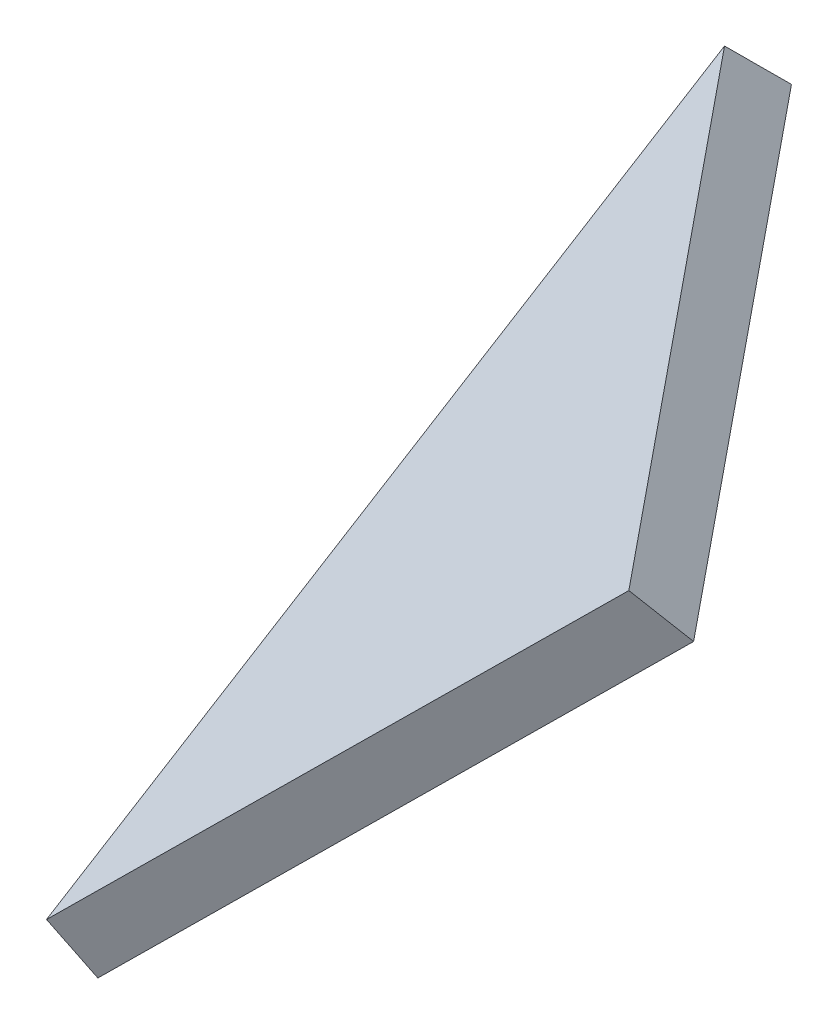
ISO-10303-21;
HEADER;
FILE_DESCRIPTION(('STEP AP214'),'2;1');
FILE_NAME('part.step','',(''),(''),'','','');
FILE_SCHEMA(('AUTOMOTIVE_DESIGN { 1 0 10303 214 1 1 1 1 }'));
ENDSEC;
DATA;
#1=APPLICATION_CONTEXT('core data for automotive mechanical design processes');
#2=APPLICATION_PROTOCOL_DEFINITION('international standard','automotive_design',2000,#1);
#3=PRODUCT_CONTEXT('',#1,'mechanical');
#4=PRODUCT('Part','Part','',(#3));
#5=PRODUCT_RELATED_PRODUCT_CATEGORY('part','',(#4));
#6=PRODUCT_DEFINITION_FORMATION('','',#4);
#7=PRODUCT_DEFINITION_CONTEXT('part definition',#1,'design');
#8=PRODUCT_DEFINITION('design','',#6,#7);
#9=PRODUCT_DEFINITION_SHAPE('','',#8);
#10=(LENGTH_UNIT() NAMED_UNIT(*) SI_UNIT(.MILLI.,.METRE.));
#11=(NAMED_UNIT(*) PLANE_ANGLE_UNIT() SI_UNIT($,.RADIAN.));
#12=(NAMED_UNIT(*) SI_UNIT($,.STERADIAN.) SOLID_ANGLE_UNIT());
#13=UNCERTAINTY_MEASURE_WITH_UNIT(LENGTH_MEASURE(1.E-05),#10,'distance_accuracy_value','');
#14=(GEOMETRIC_REPRESENTATION_CONTEXT(3) GLOBAL_UNCERTAINTY_ASSIGNED_CONTEXT((#13)) GLOBAL_UNIT_ASSIGNED_CONTEXT((#10,
#11,#12)) REPRESENTATION_CONTEXT('',''));
#15=CARTESIAN_POINT('',(0.,0.,0.));
#16=DIRECTION('',(0.,0.,1.));
#17=DIRECTION('',(1.,0.,0.));
#18=AXIS2_PLACEMENT_3D('',#15,#16,#17);
#19=CARTESIAN_POINT('',(-1476.65884613368,1541.28402140133,1039.38608885935));
#20=DIRECTION('',(0.621984011713052,-0.649204805382405,-0.437800193971784));
#21=DIRECTION('',(0.722082984412335,0.691806449537857,0.));
#22=AXIS2_PLACEMENT_3D('',#19,#20,#21);
#23=PLANE('',#22);
#24=DIRECTION('',(-0.639934480171962,-0.0992411593041402,-0.761994129496423));
#25=VECTOR('',#24,1.);
#26=CARTESIAN_POINT('',(-1470.31171783477,1551.89127497602,1032.67419674318));
#27=LINE('',#26,#25);
#28=CARTESIAN_POINT('',(-1587.10936707483,1533.77827360834,893.598829158671));
#29=VERTEX_POINT('',#28);
#30=CARTESIAN_POINT('',(-2196.82382130796,1439.22364159925,167.588824712724));
#31=VERTEX_POINT('',#30);
#32=EDGE_CURVE('E83',#29,#31,#27,.T.);
#33=ORIENTED_EDGE('',*,*,#32,.T.);
#34=DIRECTION('',(-0.0708201863945645,-0.603459227665746,0.794242697003945));
#35=VECTOR('',#34,1.);
#36=CARTESIAN_POINT('',(-2237.88728563837,1089.32161886169,628.112275984151));
#37=LINE('',#36,#35);
#38=CARTESIAN_POINT('',(-2264.2996217753,864.261946224909,924.324502406299));
#39=VERTEX_POINT('',#38);
#40=EDGE_CURVE('E79',#31,#39,#37,.T.);
#41=ORIENTED_EDGE('',*,*,#40,.T.);
#42=DIRECTION('',(0.71075466656652,0.702700386969885,-0.0322485675075297));
#43=VECTOR('',#42,1.);
#44=CARTESIAN_POINT('',(-1530.90567080644,1589.34506898054,891.048738700539));
#45=LINE('',#44,#43);
#46=EDGE_CURVE('E87',#39,#29,#45,.T.);
#47=ORIENTED_EDGE('',*,*,#46,.T.);
#48=EDGE_LOOP('',(#33,#41,#47));
#49=FACE_BOUND('',#48,.T.);
#50=ADVANCED_FACE('F34',(#49),#23,.F.);
#51=CARTESIAN_POINT('',(-1433.11996531377,1495.83968502456,1008.74007528133));
#52=DIRECTION('',(0.621984011713052,-0.649204805382405,-0.437800193971784));
#53=DIRECTION('',(0.722082984412335,0.691806449537857,0.));
#54=AXIS2_PLACEMENT_3D('',#51,#52,#53);
#55=PLANE('',#54);
#56=DIRECTION('',(-0.639934480171962,-0.0992411593041404,-0.761994129496423));
#57=VECTOR('',#56,1.);
#58=CARTESIAN_POINT('',(-2157.45516602207,1397.47399904126,125.539374914911));
#59=LINE('',#58,#57);
#60=CARTESIAN_POINT('',(-1533.67321530277,1494.21022104597,868.300078176615));
#61=VERTEX_POINT('',#60);
#62=CARTESIAN_POINT('',(-2157.45516602207,1397.47399904126,125.539374914911));
#63=VERTEX_POINT('',#62);
#64=EDGE_CURVE('E70',#61,#63,#59,.T.);
#65=ORIENTED_EDGE('',*,*,#64,.F.);
#66=DIRECTION('',(0.71075466656652,0.702700386969886,-0.0322485675075296));
#67=VECTOR('',#66,1.);
#68=CARTESIAN_POINT('',(-1533.67321530277,1494.21022104597,868.300078176615));
#69=LINE('',#68,#67);
#70=CARTESIAN_POINT('',(-2226.48778637351,809.246632214963,899.734662452094));
#71=VERTEX_POINT('',#70);
#72=EDGE_CURVE('E72',#71,#61,#69,.T.);
#73=ORIENTED_EDGE('',*,*,#72,.F.);
#74=DIRECTION('',(-0.0708201863945645,-0.603459227665746,0.794242697003945));
#75=VECTOR('',#74,1.);
#76=CARTESIAN_POINT('',(-2226.48778637351,809.246632214963,899.734662452094));
#77=LINE('',#76,#75);
#78=EDGE_CURVE('E68',#63,#71,#77,.T.);
#79=ORIENTED_EDGE('',*,*,#78,.F.);
#80=EDGE_LOOP('',(#65,#73,#79));
#81=FACE_BOUND('',#80,.T.);
#82=ADVANCED_FACE('F69',(#81),#55,.T.);
#83=CARTESIAN_POINT('',(-1530.90567080644,1589.34506898054,891.048738700539));
#84=DIRECTION('',(-0.271080576086129,0.231308114662573,-0.934351046106365));
#85=DIRECTION('',(0.71075466656652,0.702700386969885,-0.0322485675075297));
#86=AXIS2_PLACEMENT_3D('',#83,#84,#85);
#87=PLANE('',#86);
#88=ORIENTED_EDGE('',*,*,#46,.F.);
#89=DIRECTION('',(0.531503540514754,-0.773324909201225,-0.345648045313724));
#90=VECTOR('',#89,1.);
#91=CARTESIAN_POINT('',(-2349.03279629699,987.546683763741,979.428286133281));
#92=LINE('',#91,#90);
#93=EDGE_CURVE('E42',#39,#71,#92,.T.);
#94=ORIENTED_EDGE('',*,*,#93,.T.);
#95=ORIENTED_EDGE('',*,*,#72,.T.);
#96=DIRECTION('',(-0.75112735355334,0.556189875595968,0.355612880852898));
#97=VECTOR('',#96,1.);
#98=CARTESIAN_POINT('',(-1577.93262663475,1526.9831407995,889.254203591117));
#99=LINE('',#98,#97);
#100=EDGE_CURVE('E77',#61,#29,#99,.T.);
#101=ORIENTED_EDGE('',*,*,#100,.T.);
#102=EDGE_LOOP('',(#88,#94,#95,#101));
#103=FACE_BOUND('',#102,.T.);
#104=ADVANCED_FACE('F90',(#103),#87,.F.);
#105=CARTESIAN_POINT('',(-1470.31171783477,1551.89127497602,1032.67419674318));
#106=DIRECTION('',(-0.393243773583625,-0.809645214665029,0.435699392824605));
#107=DIRECTION('',(-0.639934480171962,-0.0992411593041403,-0.761994129496423));
#108=AXIS2_PLACEMENT_3D('',#105,#106,#107);
#109=PLANE('',#108);
#110=ORIENTED_EDGE('',*,*,#64,.T.);
#111=DIRECTION('',(-0.553387039994559,0.586855480539561,0.591069732710736));
#112=VECTOR('',#111,1.);
#113=CARTESIAN_POINT('',(-2293.88957674173,1542.15986242144,271.264238072902));
#114=LINE('',#113,#112);
#115=EDGE_CURVE('E11',#63,#31,#114,.T.);
#116=ORIENTED_EDGE('',*,*,#115,.T.);
#117=ORIENTED_EDGE('',*,*,#32,.F.);
#118=ORIENTED_EDGE('',*,*,#100,.F.);
#119=EDGE_LOOP('',(#110,#116,#117,#118));
#120=FACE_BOUND('',#119,.T.);
#121=ADVANCED_FACE('F75',(#120),#109,.F.);
#122=CARTESIAN_POINT('',(-2237.88728563837,1089.32161886169,628.112275984151));
#123=DIRECTION('',(0.832791727372151,0.402496838685525,0.380071353391265));
#124=DIRECTION('',(-0.0708201863945644,-0.603459227665746,0.794242697003945));
#125=AXIS2_PLACEMENT_3D('',#122,#123,#124);
#126=PLANE('',#125);
#127=ORIENTED_EDGE('',*,*,#115,.F.);
#128=ORIENTED_EDGE('',*,*,#78,.T.);
#129=ORIENTED_EDGE('',*,*,#93,.F.);
#130=ORIENTED_EDGE('',*,*,#40,.F.);
#131=EDGE_LOOP('',(#127,#128,#129,#130));
#132=FACE_BOUND('',#131,.T.);
#133=ADVANCED_FACE('F36',(#132),#126,.F.);
#134=CLOSED_SHELL('',(#50,#82,#104,#121,#133));
#135=MANIFOLD_SOLID_BREP('B2',#134);
#136=ADVANCED_BREP_SHAPE_REPRESENTATION('',(#18,#135),#14);
#137=SHAPE_DEFINITION_REPRESENTATION(#9,#136);
ENDSEC;
END-ISO-10303-21;
